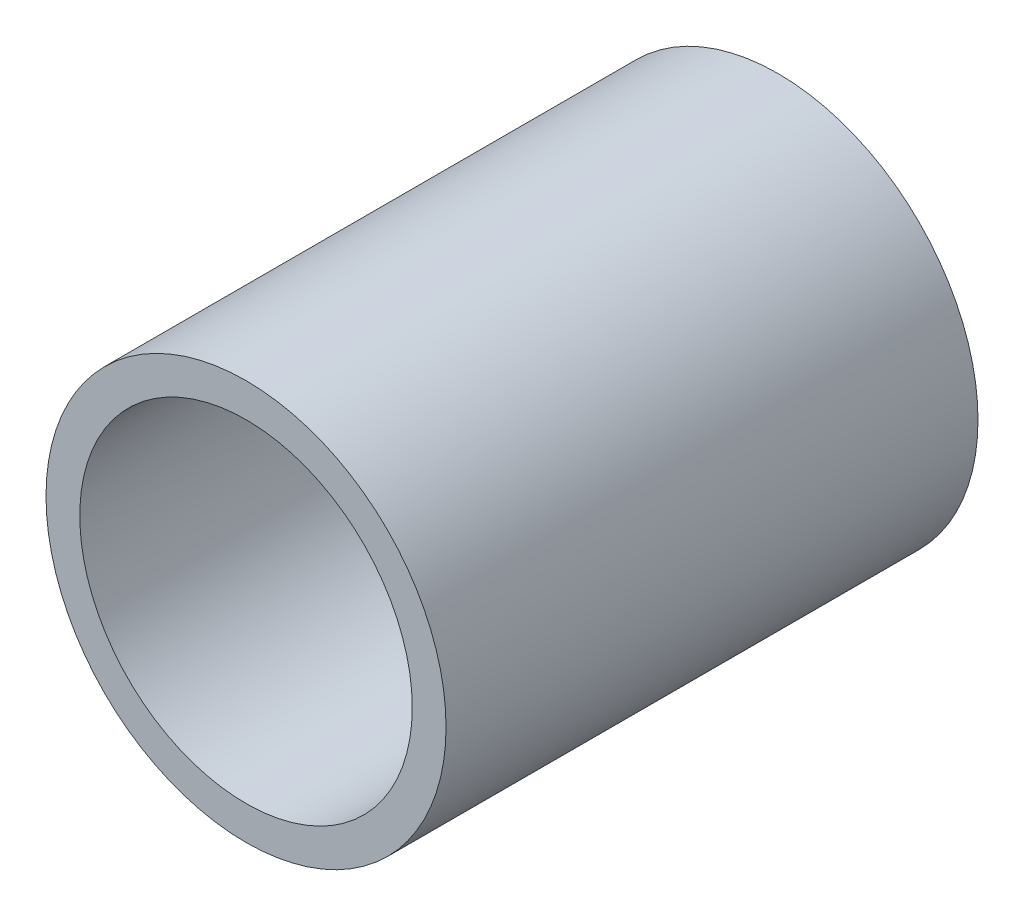
ISO-10303-21;
HEADER;
FILE_DESCRIPTION(('STEP AP214'),'2;1');
FILE_NAME('part.step','',(''),(''),'','','');
FILE_SCHEMA(('AUTOMOTIVE_DESIGN { 1 0 10303 214 1 1 1 1 }'));
ENDSEC;
DATA;
#1=APPLICATION_CONTEXT('core data for automotive mechanical design processes');
#2=APPLICATION_PROTOCOL_DEFINITION('international standard','automotive_design',2000,#1);
#3=PRODUCT_CONTEXT('',#1,'mechanical');
#4=PRODUCT('Part','Part','',(#3));
#5=PRODUCT_RELATED_PRODUCT_CATEGORY('part','',(#4));
#6=PRODUCT_DEFINITION_FORMATION('','',#4);
#7=PRODUCT_DEFINITION_CONTEXT('part definition',#1,'design');
#8=PRODUCT_DEFINITION('design','',#6,#7);
#9=PRODUCT_DEFINITION_SHAPE('','',#8);
#10=(LENGTH_UNIT() NAMED_UNIT(*) SI_UNIT(.MILLI.,.METRE.));
#11=(NAMED_UNIT(*) PLANE_ANGLE_UNIT() SI_UNIT($,.RADIAN.));
#12=(NAMED_UNIT(*) SI_UNIT($,.STERADIAN.) SOLID_ANGLE_UNIT());
#13=UNCERTAINTY_MEASURE_WITH_UNIT(LENGTH_MEASURE(1.E-05),#10,'distance_accuracy_value','');
#14=(GEOMETRIC_REPRESENTATION_CONTEXT(3) GLOBAL_UNCERTAINTY_ASSIGNED_CONTEXT((#13)) GLOBAL_UNIT_ASSIGNED_CONTEXT((#10,
#11,#12)) REPRESENTATION_CONTEXT('',''));
#15=CARTESIAN_POINT('',(0.,0.,0.));
#16=DIRECTION('',(0.,0.,1.));
#17=DIRECTION('',(1.,0.,0.));
#18=AXIS2_PLACEMENT_3D('',#15,#16,#17);
#19=CARTESIAN_POINT('',(0.,0.,6.35));
#20=DIRECTION('',(0.,0.,1.));
#21=DIRECTION('',(1.,0.,0.));
#22=AXIS2_PLACEMENT_3D('',#19,#20,#21);
#23=PLANE('',#22);
#24=CARTESIAN_POINT('',(0.,0.,6.35));
#25=DIRECTION('',(0.,0.,1.));
#26=DIRECTION('',(1.,0.,0.));
#27=AXIS2_PLACEMENT_3D('',#24,#25,#26);
#28=CIRCLE('',#27,4.7752);
#29=CARTESIAN_POINT('',(4.7752,0.,6.35));
#30=VERTEX_POINT('',#29);
#31=EDGE_CURVE('E10',#30,#30,#28,.T.);
#32=ORIENTED_EDGE('',*,*,#31,.T.);
#33=EDGE_LOOP('',(#32));
#34=FACE_BOUND('',#33,.T.);
#35=CARTESIAN_POINT('',(0.,0.,6.35));
#36=DIRECTION('',(0.,0.,1.));
#37=DIRECTION('',(1.,0.,0.));
#38=AXIS2_PLACEMENT_3D('',#35,#36,#37);
#39=CIRCLE('',#38,3.96875);
#40=CARTESIAN_POINT('',(3.96875,0.,6.35));
#41=VERTEX_POINT('',#40);
#42=EDGE_CURVE('E55',#41,#41,#39,.T.);
#43=ORIENTED_EDGE('',*,*,#42,.F.);
#44=EDGE_LOOP('',(#43));
#45=FACE_BOUND('',#44,.T.);
#46=ADVANCED_FACE('F41',(#34,#45),#23,.T.);
#47=CARTESIAN_POINT('',(0.,0.,-6.35));
#48=DIRECTION('',(0.,0.,1.));
#49=DIRECTION('',(1.,0.,0.));
#50=AXIS2_PLACEMENT_3D('',#47,#48,#49);
#51=PLANE('',#50);
#52=CARTESIAN_POINT('',(0.,0.,-6.35));
#53=DIRECTION('',(0.,0.,1.));
#54=DIRECTION('',(1.,0.,0.));
#55=AXIS2_PLACEMENT_3D('',#52,#53,#54);
#56=CIRCLE('',#55,4.7752);
#57=CARTESIAN_POINT('',(4.7752,0.,-6.35));
#58=VERTEX_POINT('',#57);
#59=EDGE_CURVE('E45',#58,#58,#56,.T.);
#60=ORIENTED_EDGE('',*,*,#59,.F.);
#61=EDGE_LOOP('',(#60));
#62=FACE_BOUND('',#61,.T.);
#63=CARTESIAN_POINT('',(0.,0.,-6.35));
#64=DIRECTION('',(0.,0.,1.));
#65=DIRECTION('',(1.,0.,0.));
#66=AXIS2_PLACEMENT_3D('',#63,#64,#65);
#67=CIRCLE('',#66,3.96875);
#68=CARTESIAN_POINT('',(3.96875,0.,-6.35));
#69=VERTEX_POINT('',#68);
#70=EDGE_CURVE('E57',#69,#69,#67,.T.);
#71=ORIENTED_EDGE('',*,*,#70,.T.);
#72=EDGE_LOOP('',(#71));
#73=FACE_BOUND('',#72,.T.);
#74=ADVANCED_FACE('F70',(#62,#73),#51,.F.);
#75=CARTESIAN_POINT('',(0.,0.,6.35));
#76=DIRECTION('',(0.,0.,-1.));
#77=DIRECTION('',(-1.,0.,0.));
#78=AXIS2_PLACEMENT_3D('',#75,#76,#77);
#79=CYLINDRICAL_SURFACE('',#78,4.7752);
#80=ORIENTED_EDGE('',*,*,#31,.F.);
#81=EDGE_LOOP('',(#80));
#82=FACE_BOUND('',#81,.T.);
#83=ORIENTED_EDGE('',*,*,#59,.T.);
#84=EDGE_LOOP('',(#83));
#85=FACE_BOUND('',#84,.T.);
#86=ADVANCED_FACE('F43',(#82,#85),#79,.T.);
#87=CARTESIAN_POINT('',(0.,0.,6.35));
#88=DIRECTION('',(0.,0.,-1.));
#89=DIRECTION('',(-1.,0.,0.));
#90=AXIS2_PLACEMENT_3D('',#87,#88,#89);
#91=CYLINDRICAL_SURFACE('',#90,3.96875);
#92=ORIENTED_EDGE('',*,*,#42,.T.);
#93=EDGE_LOOP('',(#92));
#94=FACE_BOUND('',#93,.T.);
#95=ORIENTED_EDGE('',*,*,#70,.F.);
#96=EDGE_LOOP('',(#95));
#97=FACE_BOUND('',#96,.T.);
#98=ADVANCED_FACE('F66',(#94,#97),#91,.F.);
#99=CLOSED_SHELL('',(#46,#74,#86,#98));
#100=MANIFOLD_SOLID_BREP('B2',#99);
#101=ADVANCED_BREP_SHAPE_REPRESENTATION('',(#18,#100),#14);
#102=SHAPE_DEFINITION_REPRESENTATION(#9,#101);
ENDSEC;
END-ISO-10303-21;
